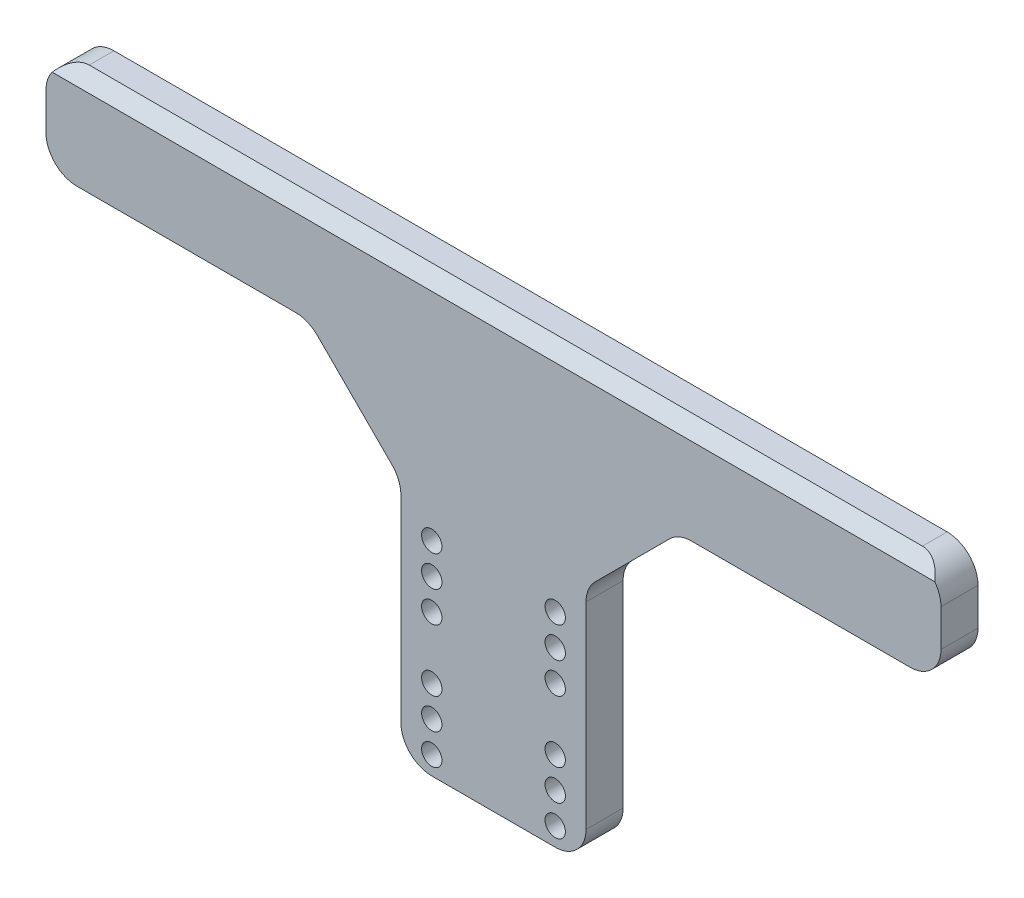
ISO-10303-21;
HEADER;
FILE_DESCRIPTION(('STEP AP214'),'2;1');
FILE_NAME('part.step','',(''),(''),'','','');
FILE_SCHEMA(('AUTOMOTIVE_DESIGN { 1 0 10303 214 1 1 1 1 }'));
ENDSEC;
DATA;
#1=APPLICATION_CONTEXT('core data for automotive mechanical design processes');
#2=APPLICATION_PROTOCOL_DEFINITION('international standard','automotive_design',2000,#1);
#3=PRODUCT_CONTEXT('',#1,'mechanical');
#4=PRODUCT('Part','Part','',(#3));
#5=PRODUCT_RELATED_PRODUCT_CATEGORY('part','',(#4));
#6=PRODUCT_DEFINITION_FORMATION('','',#4);
#7=PRODUCT_DEFINITION_CONTEXT('part definition',#1,'design');
#8=PRODUCT_DEFINITION('design','',#6,#7);
#9=PRODUCT_DEFINITION_SHAPE('','',#8);
#10=(LENGTH_UNIT() NAMED_UNIT(*) SI_UNIT(.MILLI.,.METRE.));
#11=(NAMED_UNIT(*) PLANE_ANGLE_UNIT() SI_UNIT($,.RADIAN.));
#12=(NAMED_UNIT(*) SI_UNIT($,.STERADIAN.) SOLID_ANGLE_UNIT());
#13=UNCERTAINTY_MEASURE_WITH_UNIT(LENGTH_MEASURE(1.E-05),#10,'distance_accuracy_value','');
#14=(GEOMETRIC_REPRESENTATION_CONTEXT(3) GLOBAL_UNCERTAINTY_ASSIGNED_CONTEXT((#13)) GLOBAL_UNIT_ASSIGNED_CONTEXT((#10,
#11,#12)) REPRESENTATION_CONTEXT('',''));
#15=CARTESIAN_POINT('',(0.,0.,0.));
#16=DIRECTION('',(0.,0.,1.));
#17=DIRECTION('',(1.,0.,0.));
#18=AXIS2_PLACEMENT_3D('',#15,#16,#17);
#19=CARTESIAN_POINT('',(0.,0.,6.));
#20=DIRECTION('',(1.,0.,0.));
#21=DIRECTION('',(0.,0.,-1.));
#22=AXIS2_PLACEMENT_3D('',#19,#20,#21);
#23=PLANE('',#22);
#24=DIRECTION('',(0.,-1.,0.));
#25=VECTOR('',#24,1.);
#26=CARTESIAN_POINT('',(0.,0.,6.));
#27=LINE('',#26,#25);
#28=CARTESIAN_POINT('',(0.,65.,6.));
#29=VERTEX_POINT('',#28);
#30=CARTESIAN_POINT('',(0.,59.,6.));
#31=VERTEX_POINT('',#30);
#32=EDGE_CURVE('E408',#29,#31,#27,.T.);
#33=ORIENTED_EDGE('',*,*,#32,.F.);
#34=DIRECTION('',(0.,0.,1.));
#35=VECTOR('',#34,1.);
#36=CARTESIAN_POINT('',(0.,65.,0.));
#37=LINE('',#36,#35);
#38=CARTESIAN_POINT('',(0.,65.,0.));
#39=VERTEX_POINT('',#38);
#40=EDGE_CURVE('E234',#29,#39,#37,.F.);
#41=ORIENTED_EDGE('',*,*,#40,.T.);
#42=DIRECTION('',(0.,-1.,0.));
#43=VECTOR('',#42,1.);
#44=CARTESIAN_POINT('',(0.,0.,0.));
#45=LINE('',#44,#43);
#46=CARTESIAN_POINT('',(0.,59.,0.));
#47=VERTEX_POINT('',#46);
#48=EDGE_CURVE('E407',#39,#47,#45,.T.);
#49=ORIENTED_EDGE('',*,*,#48,.T.);
#50=DIRECTION('',(0.,0.,1.));
#51=VECTOR('',#50,1.);
#52=CARTESIAN_POINT('',(0.,59.,6.));
#53=LINE('',#52,#51);
#54=EDGE_CURVE('E231',#47,#31,#53,.T.);
#55=ORIENTED_EDGE('',*,*,#54,.T.);
#56=EDGE_LOOP('',(#33,#41,#49,#55));
#57=FACE_BOUND('',#56,.T.);
#58=ADVANCED_FACE('F32',(#57),#23,.F.);
#59=CARTESIAN_POINT('',(0.,0.,6.));
#60=DIRECTION('',(0.,1.,0.));
#61=DIRECTION('',(0.,0.,1.));
#62=AXIS2_PLACEMENT_3D('',#59,#60,#61);
#63=PLANE('',#62);
#64=DIRECTION('',(1.,0.,0.));
#65=VECTOR('',#64,1.);
#66=CARTESIAN_POINT('',(0.,0.,0.));
#67=LINE('',#66,#65);
#68=CARTESIAN_POINT('',(62.5,0.,0.));
#69=VERTEX_POINT('',#68);
#70=CARTESIAN_POINT('',(82.5,0.,0.));
#71=VERTEX_POINT('',#70);
#72=EDGE_CURVE('E419',#69,#71,#67,.T.);
#73=ORIENTED_EDGE('',*,*,#72,.T.);
#74=DIRECTION('',(0.,0.,1.));
#75=VECTOR('',#74,1.);
#76=CARTESIAN_POINT('',(82.5,0.,6.));
#77=LINE('',#76,#75);
#78=CARTESIAN_POINT('',(82.5,0.,6.));
#79=VERTEX_POINT('',#78);
#80=EDGE_CURVE('E268',#71,#79,#77,.T.);
#81=ORIENTED_EDGE('',*,*,#80,.T.);
#82=DIRECTION('',(1.,0.,0.));
#83=VECTOR('',#82,1.);
#84=CARTESIAN_POINT('',(0.,0.,6.));
#85=LINE('',#84,#83);
#86=CARTESIAN_POINT('',(62.5,0.,6.));
#87=VERTEX_POINT('',#86);
#88=EDGE_CURVE('E411',#87,#79,#85,.T.);
#89=ORIENTED_EDGE('',*,*,#88,.F.);
#90=DIRECTION('',(0.,0.,1.));
#91=VECTOR('',#90,1.);
#92=CARTESIAN_POINT('',(62.5,0.,6.));
#93=LINE('',#92,#91);
#94=EDGE_CURVE('E266',#87,#69,#93,.F.);
#95=ORIENTED_EDGE('',*,*,#94,.T.);
#96=EDGE_LOOP('',(#73,#81,#89,#95));
#97=FACE_BOUND('',#96,.T.);
#98=ADVANCED_FACE('F458',(#97),#63,.F.);
#99=CARTESIAN_POINT('',(145.,0.,6.));
#100=DIRECTION('',(-1.,0.,0.));
#101=DIRECTION('',(0.,0.,1.));
#102=AXIS2_PLACEMENT_3D('',#99,#100,#101);
#103=PLANE('',#102);
#104=DIRECTION('',(0.,1.,0.));
#105=VECTOR('',#104,1.);
#106=CARTESIAN_POINT('',(145.,0.,0.));
#107=LINE('',#106,#105);
#108=CARTESIAN_POINT('',(145.,59.,0.));
#109=VERTEX_POINT('',#108);
#110=CARTESIAN_POINT('',(145.,65.,0.));
#111=VERTEX_POINT('',#110);
#112=EDGE_CURVE('E412',#109,#111,#107,.T.);
#113=ORIENTED_EDGE('',*,*,#112,.T.);
#114=DIRECTION('',(0.,0.,1.));
#115=VECTOR('',#114,1.);
#116=CARTESIAN_POINT('',(145.,65.,3.99999999999997));
#117=LINE('',#116,#115);
#118=CARTESIAN_POINT('',(145.,65.,6.));
#119=VERTEX_POINT('',#118);
#120=EDGE_CURVE('E248',#111,#119,#117,.T.);
#121=ORIENTED_EDGE('',*,*,#120,.T.);
#122=DIRECTION('',(0.,1.,0.));
#123=VECTOR('',#122,1.);
#124=CARTESIAN_POINT('',(145.,0.,6.));
#125=LINE('',#124,#123);
#126=CARTESIAN_POINT('',(145.,59.,6.));
#127=VERTEX_POINT('',#126);
#128=EDGE_CURVE('E207',#127,#119,#125,.T.);
#129=ORIENTED_EDGE('',*,*,#128,.F.);
#130=DIRECTION('',(0.,0.,1.));
#131=VECTOR('',#130,1.);
#132=CARTESIAN_POINT('',(145.,59.,6.));
#133=LINE('',#132,#131);
#134=EDGE_CURVE('E54',#127,#109,#133,.F.);
#135=ORIENTED_EDGE('',*,*,#134,.T.);
#136=EDGE_LOOP('',(#113,#121,#129,#135));
#137=FACE_BOUND('',#136,.T.);
#138=ADVANCED_FACE('F422',(#137),#103,.F.);
#139=CARTESIAN_POINT('',(0.,0.,6.));
#140=DIRECTION('',(0.,0.,-1.));
#141=DIRECTION('',(-1.,0.,0.));
#142=AXIS2_PLACEMENT_3D('',#139,#140,#141);
#143=PLANE('',#142);
#144=CARTESIAN_POINT('',(82.5,8.,6.));
#145=DIRECTION('',(0.,0.,-1.));
#146=DIRECTION('',(-1.,0.,0.));
#147=AXIS2_PLACEMENT_3D('',#144,#145,#146);
#148=CIRCLE('',#147,1.65);
#149=CARTESIAN_POINT('',(80.85,8.,6.));
#150=VERTEX_POINT('',#149);
#151=EDGE_CURVE('E398',#150,#150,#148,.T.);
#152=ORIENTED_EDGE('',*,*,#151,.T.);
#153=EDGE_LOOP('',(#152));
#154=FACE_BOUND('',#153,.T.);
#155=CARTESIAN_POINT('',(82.5,28.,6.));
#156=DIRECTION('',(0.,0.,-1.));
#157=DIRECTION('',(-1.,0.,0.));
#158=AXIS2_PLACEMENT_3D('',#155,#156,#157);
#159=CIRCLE('',#158,1.65);
#160=CARTESIAN_POINT('',(80.85,28.,6.));
#161=VERTEX_POINT('',#160);
#162=EDGE_CURVE('E395',#161,#161,#159,.T.);
#163=ORIENTED_EDGE('',*,*,#162,.T.);
#164=EDGE_LOOP('',(#163));
#165=FACE_BOUND('',#164,.T.);
#166=CARTESIAN_POINT('',(62.5,33.,6.));
#167=DIRECTION('',(0.,0.,-1.));
#168=DIRECTION('',(-1.,0.,0.));
#169=AXIS2_PLACEMENT_3D('',#166,#167,#168);
#170=CIRCLE('',#169,1.65);
#171=CARTESIAN_POINT('',(60.85,33.,6.));
#172=VERTEX_POINT('',#171);
#173=EDGE_CURVE('E392',#172,#172,#170,.T.);
#174=ORIENTED_EDGE('',*,*,#173,.T.);
#175=EDGE_LOOP('',(#174));
#176=FACE_BOUND('',#175,.T.);
#177=CARTESIAN_POINT('',(62.5,13.,6.));
#178=DIRECTION('',(0.,0.,-1.));
#179=DIRECTION('',(-1.,0.,0.));
#180=AXIS2_PLACEMENT_3D('',#177,#178,#179);
#181=CIRCLE('',#180,1.65);
#182=CARTESIAN_POINT('',(60.85,13.,6.));
#183=VERTEX_POINT('',#182);
#184=EDGE_CURVE('E389',#183,#183,#181,.T.);
#185=ORIENTED_EDGE('',*,*,#184,.T.);
#186=EDGE_LOOP('',(#185));
#187=FACE_BOUND('',#186,.T.);
#188=CARTESIAN_POINT('',(82.4999999999999,13.,6.));
#189=DIRECTION('',(0.,0.,-1.));
#190=DIRECTION('',(-1.,0.,0.));
#191=AXIS2_PLACEMENT_3D('',#188,#189,#190);
#192=CIRCLE('',#191,1.65);
#193=CARTESIAN_POINT('',(80.85,13.,6.));
#194=VERTEX_POINT('',#193);
#195=EDGE_CURVE('E386',#194,#194,#192,.T.);
#196=ORIENTED_EDGE('',*,*,#195,.T.);
#197=EDGE_LOOP('',(#196));
#198=FACE_BOUND('',#197,.T.);
#199=CARTESIAN_POINT('',(82.4999999999999,33.,6.));
#200=DIRECTION('',(0.,0.,-1.));
#201=DIRECTION('',(-1.,0.,0.));
#202=AXIS2_PLACEMENT_3D('',#199,#200,#201);
#203=CIRCLE('',#202,1.65);
#204=CARTESIAN_POINT('',(80.85,33.,6.));
#205=VERTEX_POINT('',#204);
#206=EDGE_CURVE('E383',#205,#205,#203,.T.);
#207=ORIENTED_EDGE('',*,*,#206,.T.);
#208=EDGE_LOOP('',(#207));
#209=FACE_BOUND('',#208,.T.);
#210=CARTESIAN_POINT('',(62.5,8.,6.));
#211=DIRECTION('',(0.,0.,-1.));
#212=DIRECTION('',(-1.,0.,0.));
#213=AXIS2_PLACEMENT_3D('',#210,#211,#212);
#214=CIRCLE('',#213,1.65000000000002);
#215=CARTESIAN_POINT('',(60.85,8.,6.));
#216=VERTEX_POINT('',#215);
#217=EDGE_CURVE('E380',#216,#216,#214,.T.);
#218=ORIENTED_EDGE('',*,*,#217,.T.);
#219=EDGE_LOOP('',(#218));
#220=FACE_BOUND('',#219,.T.);
#221=CARTESIAN_POINT('',(62.5,28.,6.));
#222=DIRECTION('',(0.,0.,-1.));
#223=DIRECTION('',(-1.,0.,0.));
#224=AXIS2_PLACEMENT_3D('',#221,#222,#223);
#225=CIRCLE('',#224,1.65000000000002);
#226=CARTESIAN_POINT('',(60.85,28.,6.));
#227=VERTEX_POINT('',#226);
#228=EDGE_CURVE('E377',#227,#227,#225,.T.);
#229=ORIENTED_EDGE('',*,*,#228,.T.);
#230=EDGE_LOOP('',(#229));
#231=FACE_BOUND('',#230,.T.);
#232=CARTESIAN_POINT('',(82.5,23.,6.));
#233=DIRECTION('',(0.,0.,-1.));
#234=DIRECTION('',(-1.,0.,0.));
#235=AXIS2_PLACEMENT_3D('',#232,#233,#234);
#236=CIRCLE('',#235,1.65);
#237=CARTESIAN_POINT('',(80.85,23.,6.));
#238=VERTEX_POINT('',#237);
#239=EDGE_CURVE('E374',#238,#238,#236,.T.);
#240=ORIENTED_EDGE('',*,*,#239,.T.);
#241=EDGE_LOOP('',(#240));
#242=FACE_BOUND('',#241,.T.);
#243=CARTESIAN_POINT('',(82.5,3.,6.));
#244=DIRECTION('',(0.,0.,-1.));
#245=DIRECTION('',(-1.,0.,0.));
#246=AXIS2_PLACEMENT_3D('',#243,#244,#245);
#247=CIRCLE('',#246,1.65);
#248=CARTESIAN_POINT('',(80.85,3.,6.));
#249=VERTEX_POINT('',#248);
#250=EDGE_CURVE('E371',#249,#249,#247,.T.);
#251=ORIENTED_EDGE('',*,*,#250,.T.);
#252=EDGE_LOOP('',(#251));
#253=FACE_BOUND('',#252,.T.);
#254=CARTESIAN_POINT('',(62.5,3.,6.));
#255=DIRECTION('',(0.,0.,-1.));
#256=DIRECTION('',(-1.,0.,0.));
#257=AXIS2_PLACEMENT_3D('',#254,#255,#256);
#258=CIRCLE('',#257,1.65000000000001);
#259=CARTESIAN_POINT('',(60.85,3.,6.));
#260=VERTEX_POINT('',#259);
#261=EDGE_CURVE('E357',#260,#260,#258,.T.);
#262=ORIENTED_EDGE('',*,*,#261,.T.);
#263=EDGE_LOOP('',(#262));
#264=FACE_BOUND('',#263,.T.);
#265=CARTESIAN_POINT('',(62.5,23.,6.));
#266=DIRECTION('',(0.,0.,-1.));
#267=DIRECTION('',(-1.,0.,0.));
#268=AXIS2_PLACEMENT_3D('',#265,#266,#267);
#269=CIRCLE('',#268,1.65000000000001);
#270=CARTESIAN_POINT('',(60.85,23.,6.));
#271=VERTEX_POINT('',#270);
#272=EDGE_CURVE('E404',#271,#271,#269,.T.);
#273=ORIENTED_EDGE('',*,*,#272,.T.);
#274=EDGE_LOOP('',(#273));
#275=FACE_BOUND('',#274,.T.);
#276=DIRECTION('',(-1.,0.,0.));
#277=VECTOR('',#276,1.);
#278=CARTESIAN_POINT('',(0.,68.,6.));
#279=LINE('',#278,#277);
#280=CARTESIAN_POINT('',(144.,68.,6.));
#281=VERTEX_POINT('',#280);
#282=CARTESIAN_POINT('',(1.,68.,6.));
#283=VERTEX_POINT('',#282);
#284=EDGE_CURVE('E202',#281,#283,#279,.T.);
#285=ORIENTED_EDGE('',*,*,#284,.T.);
#286=CARTESIAN_POINT('',(5.,65.,6.));
#287=DIRECTION('',(0.,0.,-1.));
#288=DIRECTION('',(-1.,0.,0.));
#289=AXIS2_PLACEMENT_3D('',#286,#287,#288);
#290=CIRCLE('',#289,5.);
#291=EDGE_CURVE('E182',#283,#29,#290,.F.);
#292=ORIENTED_EDGE('',*,*,#291,.T.);
#293=ORIENTED_EDGE('',*,*,#32,.T.);
#294=CARTESIAN_POINT('',(5.,59.,6.));
#295=DIRECTION('',(0.,0.,-1.));
#296=DIRECTION('',(-1.,0.,0.));
#297=AXIS2_PLACEMENT_3D('',#294,#295,#296);
#298=CIRCLE('',#297,5.);
#299=CARTESIAN_POINT('',(5.,54.,6.));
#300=VERTEX_POINT('',#299);
#301=EDGE_CURVE('E187',#31,#300,#298,.F.);
#302=ORIENTED_EDGE('',*,*,#301,.T.);
#303=DIRECTION('',(1.,0.,0.));
#304=VECTOR('',#303,1.);
#305=CARTESIAN_POINT('',(0.,54.,6.));
#306=LINE('',#305,#304);
#307=CARTESIAN_POINT('',(40.4289321881344,54.,6.));
#308=VERTEX_POINT('',#307);
#309=EDGE_CURVE('E303',#300,#308,#306,.T.);
#310=ORIENTED_EDGE('',*,*,#309,.T.);
#311=CARTESIAN_POINT('',(40.4289321881344,49.,6.));
#312=DIRECTION('',(0.,0.,-1.));
#313=DIRECTION('',(-1.,0.,0.));
#314=AXIS2_PLACEMENT_3D('',#311,#312,#313);
#315=CIRCLE('',#314,5.);
#316=CARTESIAN_POINT('',(43.9644660940671,52.5355339059328,6.));
#317=VERTEX_POINT('',#316);
#318=EDGE_CURVE('E40',#308,#317,#315,.T.);
#319=ORIENTED_EDGE('',*,*,#318,.T.);
#320=DIRECTION('',(-0.707106781186551,0.707106781186544,0.));
#321=VECTOR('',#320,1.);
#322=CARTESIAN_POINT('',(48.2499999999997,48.2500000000002,6.));
#323=LINE('',#322,#321);
#324=CARTESIAN_POINT('',(56.0355339059327,40.4644660940673,6.));
#325=VERTEX_POINT('',#324);
#326=EDGE_CURVE('E213',#317,#325,#323,.F.);
#327=ORIENTED_EDGE('',*,*,#326,.T.);
#328=CARTESIAN_POINT('',(52.5,36.9289321881346,6.));
#329=DIRECTION('',(0.,0.,-1.));
#330=DIRECTION('',(-1.,0.,0.));
#331=AXIS2_PLACEMENT_3D('',#328,#329,#330);
#332=CIRCLE('',#331,5.);
#333=CARTESIAN_POINT('',(57.5,36.9289321881346,6.));
#334=VERTEX_POINT('',#333);
#335=EDGE_CURVE('E296',#325,#334,#332,.T.);
#336=ORIENTED_EDGE('',*,*,#335,.T.);
#337=DIRECTION('',(0.,-1.,0.));
#338=VECTOR('',#337,1.);
#339=CARTESIAN_POINT('',(57.5,0.,6.));
#340=LINE('',#339,#338);
#341=CARTESIAN_POINT('',(57.5,5.,6.));
#342=VERTEX_POINT('',#341);
#343=EDGE_CURVE('E323',#334,#342,#340,.T.);
#344=ORIENTED_EDGE('',*,*,#343,.T.);
#345=CARTESIAN_POINT('',(62.5,5.,6.));
#346=DIRECTION('',(0.,0.,-1.));
#347=DIRECTION('',(-1.,0.,0.));
#348=AXIS2_PLACEMENT_3D('',#345,#346,#347);
#349=CIRCLE('',#348,5.);
#350=EDGE_CURVE('E222',#342,#87,#349,.F.);
#351=ORIENTED_EDGE('',*,*,#350,.T.);
#352=ORIENTED_EDGE('',*,*,#88,.T.);
#353=CARTESIAN_POINT('',(82.5,5.,6.));
#354=DIRECTION('',(0.,0.,-1.));
#355=DIRECTION('',(-1.,0.,0.));
#356=AXIS2_PLACEMENT_3D('',#353,#354,#355);
#357=CIRCLE('',#356,5.);
#358=CARTESIAN_POINT('',(87.5,5.,6.));
#359=VERTEX_POINT('',#358);
#360=EDGE_CURVE('E224',#79,#359,#357,.F.);
#361=ORIENTED_EDGE('',*,*,#360,.T.);
#362=DIRECTION('',(0.,1.,0.));
#363=VECTOR('',#362,1.);
#364=CARTESIAN_POINT('',(87.5,0.,6.));
#365=LINE('',#364,#363);
#366=CARTESIAN_POINT('',(87.5,36.9289321881344,6.));
#367=VERTEX_POINT('',#366);
#368=EDGE_CURVE('E329',#359,#367,#365,.T.);
#369=ORIENTED_EDGE('',*,*,#368,.T.);
#370=CARTESIAN_POINT('',(92.5,36.9289321881344,6.));
#371=DIRECTION('',(0.,0.,-1.));
#372=DIRECTION('',(-1.,0.,0.));
#373=AXIS2_PLACEMENT_3D('',#370,#371,#372);
#374=CIRCLE('',#373,5.);
#375=CARTESIAN_POINT('',(88.9644660940672,40.4644660940672,6.));
#376=VERTEX_POINT('',#375);
#377=EDGE_CURVE('E290',#367,#376,#374,.T.);
#378=ORIENTED_EDGE('',*,*,#377,.T.);
#379=DIRECTION('',(-0.707106781186544,-0.707106781186551,0.));
#380=VECTOR('',#379,1.);
#381=CARTESIAN_POINT('',(24.2500000000005,-24.2500000000003,6.));
#382=LINE('',#381,#380);
#383=CARTESIAN_POINT('',(101.035533905933,52.5355339059327,6.));
#384=VERTEX_POINT('',#383);
#385=EDGE_CURVE('E201',#376,#384,#382,.F.);
#386=ORIENTED_EDGE('',*,*,#385,.T.);
#387=CARTESIAN_POINT('',(104.571067811865,49.,6.));
#388=DIRECTION('',(0.,0.,-1.));
#389=DIRECTION('',(-1.,0.,0.));
#390=AXIS2_PLACEMENT_3D('',#387,#388,#389);
#391=CIRCLE('',#390,5.);
#392=CARTESIAN_POINT('',(104.571067811865,54.,6.));
#393=VERTEX_POINT('',#392);
#394=EDGE_CURVE('E288',#384,#393,#391,.T.);
#395=ORIENTED_EDGE('',*,*,#394,.T.);
#396=DIRECTION('',(1.,0.,0.));
#397=VECTOR('',#396,1.);
#398=CARTESIAN_POINT('',(0.,54.,6.));
#399=LINE('',#398,#397);
#400=CARTESIAN_POINT('',(140.,54.,6.));
#401=VERTEX_POINT('',#400);
#402=EDGE_CURVE('E440',#393,#401,#399,.T.);
#403=ORIENTED_EDGE('',*,*,#402,.T.);
#404=CARTESIAN_POINT('',(140.,59.,6.));
#405=DIRECTION('',(0.,0.,-1.));
#406=DIRECTION('',(-1.,0.,0.));
#407=AXIS2_PLACEMENT_3D('',#404,#405,#406);
#408=CIRCLE('',#407,5.);
#409=EDGE_CURVE('E226',#401,#127,#408,.F.);
#410=ORIENTED_EDGE('',*,*,#409,.T.);
#411=ORIENTED_EDGE('',*,*,#128,.T.);
#412=CARTESIAN_POINT('',(140.,65.,6.));
#413=DIRECTION('',(0.,0.,-1.));
#414=DIRECTION('',(-1.,0.,0.));
#415=AXIS2_PLACEMENT_3D('',#412,#413,#414);
#416=CIRCLE('',#415,5.);
#417=EDGE_CURVE('E228',#119,#281,#416,.F.);
#418=ORIENTED_EDGE('',*,*,#417,.T.);
#419=EDGE_LOOP('',(#285,#292,#293,#302,#310,#319,#327,#336,#344,#351,#352,#361,#369,#378,#386,
#395,#403,#410,#411,#418));
#420=FACE_BOUND('',#419,.T.);
#421=ADVANCED_FACE('F300',(#154,#165,#176,#187,#198,#209,#220,#231,#242,#253,#264,#275,#420),
#143,.F.);
#422=CARTESIAN_POINT('',(0.,0.,0.));
#423=DIRECTION('',(0.,0.,-1.));
#424=DIRECTION('',(-1.,0.,0.));
#425=AXIS2_PLACEMENT_3D('',#422,#423,#424);
#426=PLANE('',#425);
#427=ORIENTED_EDGE('',*,*,#48,.F.);
#428=CARTESIAN_POINT('',(5.,65.,0.));
#429=DIRECTION('',(0.,0.,-1.));
#430=DIRECTION('',(-1.,0.,0.));
#431=AXIS2_PLACEMENT_3D('',#428,#429,#430);
#432=CIRCLE('',#431,5.);
#433=CARTESIAN_POINT('',(5.,70.,0.));
#434=VERTEX_POINT('',#433);
#435=EDGE_CURVE('E245',#39,#434,#432,.T.);
#436=ORIENTED_EDGE('',*,*,#435,.T.);
#437=DIRECTION('',(-1.,0.,0.));
#438=VECTOR('',#437,1.);
#439=CARTESIAN_POINT('',(0.,70.,0.));
#440=LINE('',#439,#438);
#441=CARTESIAN_POINT('',(140.,70.,0.));
#442=VERTEX_POINT('',#441);
#443=EDGE_CURVE('E196',#442,#434,#440,.T.);
#444=ORIENTED_EDGE('',*,*,#443,.F.);
#445=CARTESIAN_POINT('',(140.,65.,0.));
#446=DIRECTION('',(0.,0.,-1.));
#447=DIRECTION('',(-1.,0.,0.));
#448=AXIS2_PLACEMENT_3D('',#445,#446,#447);
#449=CIRCLE('',#448,5.);
#450=EDGE_CURVE('E47',#442,#111,#449,.T.);
#451=ORIENTED_EDGE('',*,*,#450,.T.);
#452=ORIENTED_EDGE('',*,*,#112,.F.);
#453=CARTESIAN_POINT('',(140.,59.,0.));
#454=DIRECTION('',(0.,0.,-1.));
#455=DIRECTION('',(-1.,0.,0.));
#456=AXIS2_PLACEMENT_3D('',#453,#454,#455);
#457=CIRCLE('',#456,5.);
#458=CARTESIAN_POINT('',(140.,54.,0.));
#459=VERTEX_POINT('',#458);
#460=EDGE_CURVE('E242',#109,#459,#457,.T.);
#461=ORIENTED_EDGE('',*,*,#460,.T.);
#462=DIRECTION('',(-1.,0.,0.));
#463=VECTOR('',#462,1.);
#464=CARTESIAN_POINT('',(145.,54.,0.));
#465=LINE('',#464,#463);
#466=CARTESIAN_POINT('',(104.571067811865,54.,0.));
#467=VERTEX_POINT('',#466);
#468=EDGE_CURVE('E432',#459,#467,#465,.T.);
#469=ORIENTED_EDGE('',*,*,#468,.T.);
#470=CARTESIAN_POINT('',(104.571067811865,49.,0.));
#471=DIRECTION('',(0.,0.,-1.));
#472=DIRECTION('',(-1.,0.,0.));
#473=AXIS2_PLACEMENT_3D('',#470,#471,#472);
#474=CIRCLE('',#473,5.);
#475=CARTESIAN_POINT('',(101.035533905933,52.5355339059327,0.));
#476=VERTEX_POINT('',#475);
#477=EDGE_CURVE('E286',#467,#476,#474,.F.);
#478=ORIENTED_EDGE('',*,*,#477,.T.);
#479=DIRECTION('',(0.707106781186544,0.707106781186551,0.));
#480=VECTOR('',#479,1.);
#481=CARTESIAN_POINT('',(87.5,38.9999999999999,0.));
#482=LINE('',#481,#480);
#483=CARTESIAN_POINT('',(88.9644660940672,40.4644660940672,0.));
#484=VERTEX_POINT('',#483);
#485=EDGE_CURVE('E205',#476,#484,#482,.F.);
#486=ORIENTED_EDGE('',*,*,#485,.T.);
#487=CARTESIAN_POINT('',(92.5,36.9289321881344,0.));
#488=DIRECTION('',(0.,0.,-1.));
#489=DIRECTION('',(-1.,0.,0.));
#490=AXIS2_PLACEMENT_3D('',#487,#488,#489);
#491=CIRCLE('',#490,5.);
#492=CARTESIAN_POINT('',(87.5,36.9289321881344,0.));
#493=VERTEX_POINT('',#492);
#494=EDGE_CURVE('E292',#484,#493,#491,.F.);
#495=ORIENTED_EDGE('',*,*,#494,.T.);
#496=DIRECTION('',(0.,-1.,0.));
#497=VECTOR('',#496,1.);
#498=CARTESIAN_POINT('',(87.5,0.,0.));
#499=LINE('',#498,#497);
#500=CARTESIAN_POINT('',(87.5,5.,0.));
#501=VERTEX_POINT('',#500);
#502=EDGE_CURVE('E437',#493,#501,#499,.T.);
#503=ORIENTED_EDGE('',*,*,#502,.T.);
#504=CARTESIAN_POINT('',(82.5,5.,0.));
#505=DIRECTION('',(0.,0.,-1.));
#506=DIRECTION('',(-1.,0.,0.));
#507=AXIS2_PLACEMENT_3D('',#504,#505,#506);
#508=CIRCLE('',#507,5.);
#509=EDGE_CURVE('E240',#501,#71,#508,.T.);
#510=ORIENTED_EDGE('',*,*,#509,.T.);
#511=ORIENTED_EDGE('',*,*,#72,.F.);
#512=CARTESIAN_POINT('',(62.5,5.,0.));
#513=DIRECTION('',(0.,0.,-1.));
#514=DIRECTION('',(-1.,0.,0.));
#515=AXIS2_PLACEMENT_3D('',#512,#513,#514);
#516=CIRCLE('',#515,5.);
#517=CARTESIAN_POINT('',(57.5,5.,0.));
#518=VERTEX_POINT('',#517);
#519=EDGE_CURVE('E238',#69,#518,#516,.T.);
#520=ORIENTED_EDGE('',*,*,#519,.T.);
#521=DIRECTION('',(0.,1.,0.));
#522=VECTOR('',#521,1.);
#523=CARTESIAN_POINT('',(57.5,0.,0.));
#524=LINE('',#523,#522);
#525=CARTESIAN_POINT('',(57.5,36.9289321881346,0.));
#526=VERTEX_POINT('',#525);
#527=EDGE_CURVE('E324',#518,#526,#524,.T.);
#528=ORIENTED_EDGE('',*,*,#527,.T.);
#529=CARTESIAN_POINT('',(52.5,36.9289321881346,0.));
#530=DIRECTION('',(0.,0.,-1.));
#531=DIRECTION('',(-1.,0.,0.));
#532=AXIS2_PLACEMENT_3D('',#529,#530,#531);
#533=CIRCLE('',#532,5.);
#534=CARTESIAN_POINT('',(56.0355339059327,40.4644660940673,0.));
#535=VERTEX_POINT('',#534);
#536=EDGE_CURVE('E294',#526,#535,#533,.F.);
#537=ORIENTED_EDGE('',*,*,#536,.T.);
#538=DIRECTION('',(0.707106781186551,-0.707106781186544,0.));
#539=VECTOR('',#538,1.);
#540=CARTESIAN_POINT('',(42.4999999999999,54.,0.));
#541=LINE('',#540,#539);
#542=CARTESIAN_POINT('',(43.9644660940671,52.5355339059328,0.));
#543=VERTEX_POINT('',#542);
#544=EDGE_CURVE('E216',#535,#543,#541,.F.);
#545=ORIENTED_EDGE('',*,*,#544,.T.);
#546=CARTESIAN_POINT('',(40.4289321881344,49.,0.));
#547=DIRECTION('',(0.,0.,-1.));
#548=DIRECTION('',(-1.,0.,0.));
#549=AXIS2_PLACEMENT_3D('',#546,#547,#548);
#550=CIRCLE('',#549,5.);
#551=CARTESIAN_POINT('',(40.4289321881344,54.,0.));
#552=VERTEX_POINT('',#551);
#553=EDGE_CURVE('E11',#543,#552,#550,.F.);
#554=ORIENTED_EDGE('',*,*,#553,.T.);
#555=DIRECTION('',(-1.,0.,0.));
#556=VECTOR('',#555,1.);
#557=CARTESIAN_POINT('',(0.,54.,0.));
#558=LINE('',#557,#556);
#559=CARTESIAN_POINT('',(5.,54.,0.));
#560=VERTEX_POINT('',#559);
#561=EDGE_CURVE('E318',#552,#560,#558,.T.);
#562=ORIENTED_EDGE('',*,*,#561,.T.);
#563=CARTESIAN_POINT('',(5.,59.,0.));
#564=DIRECTION('',(0.,0.,-1.));
#565=DIRECTION('',(-1.,0.,0.));
#566=AXIS2_PLACEMENT_3D('',#563,#564,#565);
#567=CIRCLE('',#566,5.);
#568=EDGE_CURVE('E236',#560,#47,#567,.T.);
#569=ORIENTED_EDGE('',*,*,#568,.T.);
#570=EDGE_LOOP('',(#427,#436,#444,#451,#452,#461,#469,#478,#486,#495,#503,#510,#511,#520,#528,
#537,#545,#554,#562,#569));
#571=FACE_BOUND('',#570,.T.);
#572=CARTESIAN_POINT('',(82.5,8.,0.));
#573=DIRECTION('',(0.,0.,1.));
#574=DIRECTION('',(1.,0.,0.));
#575=AXIS2_PLACEMENT_3D('',#572,#573,#574);
#576=CIRCLE('',#575,1.65);
#577=CARTESIAN_POINT('',(84.15,8.,0.));
#578=VERTEX_POINT('',#577);
#579=EDGE_CURVE('E345',#578,#578,#576,.T.);
#580=ORIENTED_EDGE('',*,*,#579,.T.);
#581=EDGE_LOOP('',(#580));
#582=FACE_BOUND('',#581,.T.);
#583=CARTESIAN_POINT('',(82.5,28.,0.));
#584=DIRECTION('',(0.,0.,1.));
#585=DIRECTION('',(-1.,0.,0.));
#586=AXIS2_PLACEMENT_3D('',#583,#584,#585);
#587=CIRCLE('',#586,1.65);
#588=CARTESIAN_POINT('',(80.85,28.,0.));
#589=VERTEX_POINT('',#588);
#590=EDGE_CURVE('E349',#589,#589,#587,.T.);
#591=ORIENTED_EDGE('',*,*,#590,.T.);
#592=EDGE_LOOP('',(#591));
#593=FACE_BOUND('',#592,.T.);
#594=CARTESIAN_POINT('',(62.5,33.,0.));
#595=DIRECTION('',(0.,0.,1.));
#596=DIRECTION('',(1.,0.,0.));
#597=AXIS2_PLACEMENT_3D('',#594,#595,#596);
#598=CIRCLE('',#597,1.65);
#599=CARTESIAN_POINT('',(64.15,33.,0.));
#600=VERTEX_POINT('',#599);
#601=EDGE_CURVE('E339',#600,#600,#598,.T.);
#602=ORIENTED_EDGE('',*,*,#601,.T.);
#603=EDGE_LOOP('',(#602));
#604=FACE_BOUND('',#603,.T.);
#605=CARTESIAN_POINT('',(62.5,13.,0.));
#606=DIRECTION('',(0.,0.,1.));
#607=DIRECTION('',(-1.,0.,0.));
#608=AXIS2_PLACEMENT_3D('',#605,#606,#607);
#609=CIRCLE('',#608,1.65);
#610=CARTESIAN_POINT('',(60.85,13.,0.));
#611=VERTEX_POINT('',#610);
#612=EDGE_CURVE('E336',#611,#611,#609,.T.);
#613=ORIENTED_EDGE('',*,*,#612,.T.);
#614=EDGE_LOOP('',(#613));
#615=FACE_BOUND('',#614,.T.);
#616=CARTESIAN_POINT('',(82.4999999999999,13.,0.));
#617=DIRECTION('',(0.,0.,1.));
#618=DIRECTION('',(1.,0.,0.));
#619=AXIS2_PLACEMENT_3D('',#616,#617,#618);
#620=CIRCLE('',#619,1.65);
#621=CARTESIAN_POINT('',(84.1499999999999,13.,0.));
#622=VERTEX_POINT('',#621);
#623=EDGE_CURVE('E340',#622,#622,#620,.T.);
#624=ORIENTED_EDGE('',*,*,#623,.T.);
#625=EDGE_LOOP('',(#624));
#626=FACE_BOUND('',#625,.T.);
#627=CARTESIAN_POINT('',(82.4999999999999,33.,0.));
#628=DIRECTION('',(0.,0.,1.));
#629=DIRECTION('',(-1.,0.,0.));
#630=AXIS2_PLACEMENT_3D('',#627,#628,#629);
#631=CIRCLE('',#630,1.65);
#632=CARTESIAN_POINT('',(80.85,33.,0.));
#633=VERTEX_POINT('',#632);
#634=EDGE_CURVE('E335',#633,#633,#631,.T.);
#635=ORIENTED_EDGE('',*,*,#634,.T.);
#636=EDGE_LOOP('',(#635));
#637=FACE_BOUND('',#636,.T.);
#638=CARTESIAN_POINT('',(62.5,8.,0.));
#639=DIRECTION('',(0.,0.,1.));
#640=DIRECTION('',(-1.,0.,0.));
#641=AXIS2_PLACEMENT_3D('',#638,#639,#640);
#642=CIRCLE('',#641,1.65000000000002);
#643=CARTESIAN_POINT('',(60.85,8.,0.));
#644=VERTEX_POINT('',#643);
#645=EDGE_CURVE('E348',#644,#644,#642,.T.);
#646=ORIENTED_EDGE('',*,*,#645,.T.);
#647=EDGE_LOOP('',(#646));
#648=FACE_BOUND('',#647,.T.);
#649=CARTESIAN_POINT('',(62.5,28.,0.));
#650=DIRECTION('',(0.,0.,1.));
#651=DIRECTION('',(1.,0.,0.));
#652=AXIS2_PLACEMENT_3D('',#649,#650,#651);
#653=CIRCLE('',#652,1.65000000000002);
#654=CARTESIAN_POINT('',(64.15,28.,0.));
#655=VERTEX_POINT('',#654);
#656=EDGE_CURVE('E364',#655,#655,#653,.T.);
#657=ORIENTED_EDGE('',*,*,#656,.T.);
#658=EDGE_LOOP('',(#657));
#659=FACE_BOUND('',#658,.T.);
#660=CARTESIAN_POINT('',(82.5,23.,0.));
#661=DIRECTION('',(0.,0.,1.));
#662=DIRECTION('',(-1.,0.,0.));
#663=AXIS2_PLACEMENT_3D('',#660,#661,#662);
#664=CIRCLE('',#663,1.65);
#665=CARTESIAN_POINT('',(80.85,23.,0.));
#666=VERTEX_POINT('',#665);
#667=EDGE_CURVE('E361',#666,#666,#664,.T.);
#668=ORIENTED_EDGE('',*,*,#667,.T.);
#669=EDGE_LOOP('',(#668));
#670=FACE_BOUND('',#669,.T.);
#671=CARTESIAN_POINT('',(82.5,3.,0.));
#672=DIRECTION('',(0.,0.,1.));
#673=DIRECTION('',(1.,0.,0.));
#674=AXIS2_PLACEMENT_3D('',#671,#672,#673);
#675=CIRCLE('',#674,1.65);
#676=CARTESIAN_POINT('',(84.15,3.,0.));
#677=VERTEX_POINT('',#676);
#678=EDGE_CURVE('E358',#677,#677,#675,.T.);
#679=ORIENTED_EDGE('',*,*,#678,.T.);
#680=EDGE_LOOP('',(#679));
#681=FACE_BOUND('',#680,.T.);
#682=CARTESIAN_POINT('',(62.5,3.,0.));
#683=DIRECTION('',(0.,0.,1.));
#684=DIRECTION('',(-1.,0.,0.));
#685=AXIS2_PLACEMENT_3D('',#682,#683,#684);
#686=CIRCLE('',#685,1.65000000000001);
#687=CARTESIAN_POINT('',(60.85,3.,0.));
#688=VERTEX_POINT('',#687);
#689=EDGE_CURVE('E354',#688,#688,#686,.T.);
#690=ORIENTED_EDGE('',*,*,#689,.T.);
#691=EDGE_LOOP('',(#690));
#692=FACE_BOUND('',#691,.T.);
#693=CARTESIAN_POINT('',(62.5,23.,0.));
#694=DIRECTION('',(0.,0.,1.));
#695=DIRECTION('',(1.,0.,0.));
#696=AXIS2_PLACEMENT_3D('',#693,#694,#695);
#697=CIRCLE('',#696,1.65000000000001);
#698=CARTESIAN_POINT('',(64.15,23.,0.));
#699=VERTEX_POINT('',#698);
#700=EDGE_CURVE('E401',#699,#699,#697,.T.);
#701=ORIENTED_EDGE('',*,*,#700,.T.);
#702=EDGE_LOOP('',(#701));
#703=FACE_BOUND('',#702,.T.);
#704=ADVANCED_FACE('F316',(#571,#582,#593,#604,#615,#626,#637,#648,#659,#670,#681,#692,#703),
#426,.T.);
#705=CARTESIAN_POINT('',(62.5,23.,0.));
#706=DIRECTION('',(0.,0.,1.));
#707=DIRECTION('',(1.,0.,0.));
#708=AXIS2_PLACEMENT_3D('',#705,#706,#707);
#709=CYLINDRICAL_SURFACE('',#708,1.65000000000001);
#710=ORIENTED_EDGE('',*,*,#700,.F.);
#711=EDGE_LOOP('',(#710));
#712=FACE_BOUND('',#711,.T.);
#713=ORIENTED_EDGE('',*,*,#272,.F.);
#714=EDGE_LOOP('',(#713));
#715=FACE_BOUND('',#714,.T.);
#716=ADVANCED_FACE('F626',(#712,#715),#709,.F.);
#717=CARTESIAN_POINT('',(62.5,3.,0.));
#718=DIRECTION('',(0.,0.,1.));
#719=DIRECTION('',(1.,0.,0.));
#720=AXIS2_PLACEMENT_3D('',#717,#718,#719);
#721=CYLINDRICAL_SURFACE('',#720,1.65000000000001);
#722=ORIENTED_EDGE('',*,*,#689,.F.);
#723=EDGE_LOOP('',(#722));
#724=FACE_BOUND('',#723,.T.);
#725=ORIENTED_EDGE('',*,*,#261,.F.);
#726=EDGE_LOOP('',(#725));
#727=FACE_BOUND('',#726,.T.);
#728=ADVANCED_FACE('F747',(#724,#727),#721,.F.);
#729=CARTESIAN_POINT('',(82.5,3.,0.));
#730=DIRECTION('',(0.,0.,1.));
#731=DIRECTION('',(1.,0.,0.));
#732=AXIS2_PLACEMENT_3D('',#729,#730,#731);
#733=CYLINDRICAL_SURFACE('',#732,1.65);
#734=ORIENTED_EDGE('',*,*,#678,.F.);
#735=EDGE_LOOP('',(#734));
#736=FACE_BOUND('',#735,.T.);
#737=ORIENTED_EDGE('',*,*,#250,.F.);
#738=EDGE_LOOP('',(#737));
#739=FACE_BOUND('',#738,.T.);
#740=ADVANCED_FACE('F738',(#736,#739),#733,.F.);
#741=CARTESIAN_POINT('',(82.5,23.,0.));
#742=DIRECTION('',(0.,0.,1.));
#743=DIRECTION('',(1.,0.,0.));
#744=AXIS2_PLACEMENT_3D('',#741,#742,#743);
#745=CYLINDRICAL_SURFACE('',#744,1.65);
#746=ORIENTED_EDGE('',*,*,#667,.F.);
#747=EDGE_LOOP('',(#746));
#748=FACE_BOUND('',#747,.T.);
#749=ORIENTED_EDGE('',*,*,#239,.F.);
#750=EDGE_LOOP('',(#749));
#751=FACE_BOUND('',#750,.T.);
#752=ADVANCED_FACE('F729',(#748,#751),#745,.F.);
#753=CARTESIAN_POINT('',(62.5,28.,0.));
#754=DIRECTION('',(0.,0.,1.));
#755=DIRECTION('',(1.,0.,0.));
#756=AXIS2_PLACEMENT_3D('',#753,#754,#755);
#757=CYLINDRICAL_SURFACE('',#756,1.65000000000002);
#758=ORIENTED_EDGE('',*,*,#656,.F.);
#759=EDGE_LOOP('',(#758));
#760=FACE_BOUND('',#759,.T.);
#761=ORIENTED_EDGE('',*,*,#228,.F.);
#762=EDGE_LOOP('',(#761));
#763=FACE_BOUND('',#762,.T.);
#764=ADVANCED_FACE('F720',(#760,#763),#757,.F.);
#765=CARTESIAN_POINT('',(62.5,8.,0.));
#766=DIRECTION('',(0.,0.,1.));
#767=DIRECTION('',(1.,0.,0.));
#768=AXIS2_PLACEMENT_3D('',#765,#766,#767);
#769=CYLINDRICAL_SURFACE('',#768,1.65000000000002);
#770=ORIENTED_EDGE('',*,*,#645,.F.);
#771=EDGE_LOOP('',(#770));
#772=FACE_BOUND('',#771,.T.);
#773=ORIENTED_EDGE('',*,*,#217,.F.);
#774=EDGE_LOOP('',(#773));
#775=FACE_BOUND('',#774,.T.);
#776=ADVANCED_FACE('F711',(#772,#775),#769,.F.);
#777=CARTESIAN_POINT('',(82.4999999999999,33.,0.));
#778=DIRECTION('',(0.,0.,1.));
#779=DIRECTION('',(1.,0.,0.));
#780=AXIS2_PLACEMENT_3D('',#777,#778,#779);
#781=CYLINDRICAL_SURFACE('',#780,1.65);
#782=ORIENTED_EDGE('',*,*,#634,.F.);
#783=EDGE_LOOP('',(#782));
#784=FACE_BOUND('',#783,.T.);
#785=ORIENTED_EDGE('',*,*,#206,.F.);
#786=EDGE_LOOP('',(#785));
#787=FACE_BOUND('',#786,.T.);
#788=ADVANCED_FACE('F702',(#784,#787),#781,.F.);
#789=CARTESIAN_POINT('',(82.4999999999999,13.,0.));
#790=DIRECTION('',(0.,0.,1.));
#791=DIRECTION('',(1.,0.,0.));
#792=AXIS2_PLACEMENT_3D('',#789,#790,#791);
#793=CYLINDRICAL_SURFACE('',#792,1.65);
#794=ORIENTED_EDGE('',*,*,#623,.F.);
#795=EDGE_LOOP('',(#794));
#796=FACE_BOUND('',#795,.T.);
#797=ORIENTED_EDGE('',*,*,#195,.F.);
#798=EDGE_LOOP('',(#797));
#799=FACE_BOUND('',#798,.T.);
#800=ADVANCED_FACE('F693',(#796,#799),#793,.F.);
#801=CARTESIAN_POINT('',(62.5,13.,0.));
#802=DIRECTION('',(0.,0.,1.));
#803=DIRECTION('',(1.,0.,0.));
#804=AXIS2_PLACEMENT_3D('',#801,#802,#803);
#805=CYLINDRICAL_SURFACE('',#804,1.65);
#806=ORIENTED_EDGE('',*,*,#612,.F.);
#807=EDGE_LOOP('',(#806));
#808=FACE_BOUND('',#807,.T.);
#809=ORIENTED_EDGE('',*,*,#184,.F.);
#810=EDGE_LOOP('',(#809));
#811=FACE_BOUND('',#810,.T.);
#812=ADVANCED_FACE('F684',(#808,#811),#805,.F.);
#813=CARTESIAN_POINT('',(62.5,33.,0.));
#814=DIRECTION('',(0.,0.,1.));
#815=DIRECTION('',(1.,0.,0.));
#816=AXIS2_PLACEMENT_3D('',#813,#814,#815);
#817=CYLINDRICAL_SURFACE('',#816,1.65);
#818=ORIENTED_EDGE('',*,*,#601,.F.);
#819=EDGE_LOOP('',(#818));
#820=FACE_BOUND('',#819,.T.);
#821=ORIENTED_EDGE('',*,*,#173,.F.);
#822=EDGE_LOOP('',(#821));
#823=FACE_BOUND('',#822,.T.);
#824=ADVANCED_FACE('F675',(#820,#823),#817,.F.);
#825=CARTESIAN_POINT('',(82.5,28.,0.));
#826=DIRECTION('',(0.,0.,1.));
#827=DIRECTION('',(1.,0.,0.));
#828=AXIS2_PLACEMENT_3D('',#825,#826,#827);
#829=CYLINDRICAL_SURFACE('',#828,1.65);
#830=ORIENTED_EDGE('',*,*,#590,.F.);
#831=EDGE_LOOP('',(#830));
#832=FACE_BOUND('',#831,.T.);
#833=ORIENTED_EDGE('',*,*,#162,.F.);
#834=EDGE_LOOP('',(#833));
#835=FACE_BOUND('',#834,.T.);
#836=ADVANCED_FACE('F666',(#832,#835),#829,.F.);
#837=CARTESIAN_POINT('',(82.5,8.,0.));
#838=DIRECTION('',(0.,0.,1.));
#839=DIRECTION('',(1.,0.,0.));
#840=AXIS2_PLACEMENT_3D('',#837,#838,#839);
#841=CYLINDRICAL_SURFACE('',#840,1.65);
#842=ORIENTED_EDGE('',*,*,#579,.F.);
#843=EDGE_LOOP('',(#842));
#844=FACE_BOUND('',#843,.T.);
#845=ORIENTED_EDGE('',*,*,#151,.F.);
#846=EDGE_LOOP('',(#845));
#847=FACE_BOUND('',#846,.T.);
#848=ADVANCED_FACE('F617',(#844,#847),#841,.F.);
#849=CARTESIAN_POINT('',(0.,70.,0.));
#850=DIRECTION('',(0.,1.,0.));
#851=DIRECTION('',(0.,0.,1.));
#852=AXIS2_PLACEMENT_3D('',#849,#850,#851);
#853=PLANE('',#852);
#854=ORIENTED_EDGE('',*,*,#443,.T.);
#855=DIRECTION('',(0.,0.,1.));
#856=VECTOR('',#855,1.);
#857=CARTESIAN_POINT('',(5.,70.,3.99999999999997));
#858=LINE('',#857,#856);
#859=CARTESIAN_POINT('',(5.,70.,3.99999999999997));
#860=VERTEX_POINT('',#859);
#861=EDGE_CURVE('E180',#434,#860,#858,.T.);
#862=ORIENTED_EDGE('',*,*,#861,.T.);
#863=DIRECTION('',(1.,0.,0.));
#864=VECTOR('',#863,1.);
#865=CARTESIAN_POINT('',(145.,70.,3.99999999999997));
#866=LINE('',#865,#864);
#867=CARTESIAN_POINT('',(140.,70.,3.99999999999997));
#868=VERTEX_POINT('',#867);
#869=EDGE_CURVE('E194',#860,#868,#866,.T.);
#870=ORIENTED_EDGE('',*,*,#869,.T.);
#871=DIRECTION('',(0.,0.,1.));
#872=VECTOR('',#871,1.);
#873=CARTESIAN_POINT('',(140.,70.,0.));
#874=LINE('',#873,#872);
#875=EDGE_CURVE('E197',#868,#442,#874,.F.);
#876=ORIENTED_EDGE('',*,*,#875,.T.);
#877=EDGE_LOOP('',(#854,#862,#870,#876));
#878=FACE_BOUND('',#877,.T.);
#879=ADVANCED_FACE('F193',(#878),#853,.T.);
#880=CARTESIAN_POINT('',(0.,68.,6.));
#881=DIRECTION('',(0.,0.707106781186552,0.707106781186542));
#882=DIRECTION('',(1.,0.,0.));
#883=AXIS2_PLACEMENT_3D('',#880,#881,#882);
#884=PLANE('',#883);
#885=ORIENTED_EDGE('',*,*,#869,.F.);
#886=CARTESIAN_POINT('',(5.,65.,9.00000000000004));
#887=DIRECTION('',(0.,0.707106781186552,0.707106781186542));
#888=DIRECTION('',(0.,0.707106781186543,-0.707106781186552));
#889=AXIS2_PLACEMENT_3D('',#886,#887,#888);
#890=ELLIPSE('',#889,7.07106781186553,5.);
#891=EDGE_CURVE('E176',#860,#283,#890,.T.);
#892=ORIENTED_EDGE('',*,*,#891,.T.);
#893=ORIENTED_EDGE('',*,*,#284,.F.);
#894=CARTESIAN_POINT('',(140.,65.,9.00000000000004));
#895=DIRECTION('',(0.,0.707106781186552,0.707106781186542));
#896=DIRECTION('',(0.,0.707106781186543,-0.707106781186552));
#897=AXIS2_PLACEMENT_3D('',#894,#895,#896);
#898=ELLIPSE('',#897,7.07106781186553,5.);
#899=EDGE_CURVE('E188',#281,#868,#898,.T.);
#900=ORIENTED_EDGE('',*,*,#899,.T.);
#901=EDGE_LOOP('',(#885,#892,#893,#900));
#902=FACE_BOUND('',#901,.T.);
#903=ADVANCED_FACE('F199',(#902),#884,.T.);
#904=CARTESIAN_POINT('',(0.,54.,0.));
#905=DIRECTION('',(0.,1.,0.));
#906=DIRECTION('',(0.,0.,1.));
#907=AXIS2_PLACEMENT_3D('',#904,#905,#906);
#908=PLANE('',#907);
#909=ORIENTED_EDGE('',*,*,#561,.F.);
#910=DIRECTION('',(0.,0.,-1.));
#911=VECTOR('',#910,1.);
#912=CARTESIAN_POINT('',(40.4289321881344,54.,6.));
#913=LINE('',#912,#911);
#914=EDGE_CURVE('E283',#552,#308,#913,.F.);
#915=ORIENTED_EDGE('',*,*,#914,.T.);
#916=ORIENTED_EDGE('',*,*,#309,.F.);
#917=DIRECTION('',(0.,0.,1.));
#918=VECTOR('',#917,1.);
#919=CARTESIAN_POINT('',(5.,54.,0.));
#920=LINE('',#919,#918);
#921=EDGE_CURVE('E281',#300,#560,#920,.F.);
#922=ORIENTED_EDGE('',*,*,#921,.T.);
#923=EDGE_LOOP('',(#909,#915,#916,#922));
#924=FACE_BOUND('',#923,.T.);
#925=ADVANCED_FACE('F321',(#924),#908,.F.);
#926=CARTESIAN_POINT('',(57.5,0.,0.));
#927=DIRECTION('',(1.,0.,0.));
#928=DIRECTION('',(0.,0.,-1.));
#929=AXIS2_PLACEMENT_3D('',#926,#927,#928);
#930=PLANE('',#929);
#931=ORIENTED_EDGE('',*,*,#527,.F.);
#932=DIRECTION('',(0.,0.,1.));
#933=VECTOR('',#932,1.);
#934=CARTESIAN_POINT('',(57.5,5.,0.));
#935=LINE('',#934,#933);
#936=EDGE_CURVE('E274',#518,#342,#935,.T.);
#937=ORIENTED_EDGE('',*,*,#936,.T.);
#938=ORIENTED_EDGE('',*,*,#343,.F.);
#939=DIRECTION('',(0.,0.,1.));
#940=VECTOR('',#939,1.);
#941=CARTESIAN_POINT('',(57.5,36.9289321881346,0.));
#942=LINE('',#941,#940);
#943=EDGE_CURVE('E271',#334,#526,#942,.F.);
#944=ORIENTED_EDGE('',*,*,#943,.T.);
#945=EDGE_LOOP('',(#931,#937,#938,#944));
#946=FACE_BOUND('',#945,.T.);
#947=ADVANCED_FACE('F466',(#946),#930,.F.);
#948=CARTESIAN_POINT('',(87.5,0.,0.));
#949=DIRECTION('',(-1.,0.,0.));
#950=DIRECTION('',(0.,0.,1.));
#951=AXIS2_PLACEMENT_3D('',#948,#949,#950);
#952=PLANE('',#951);
#953=ORIENTED_EDGE('',*,*,#502,.F.);
#954=DIRECTION('',(0.,0.,-1.));
#955=VECTOR('',#954,1.);
#956=CARTESIAN_POINT('',(87.5,36.9289321881344,6.));
#957=LINE('',#956,#955);
#958=EDGE_CURVE('E263',#493,#367,#957,.F.);
#959=ORIENTED_EDGE('',*,*,#958,.T.);
#960=ORIENTED_EDGE('',*,*,#368,.F.);
#961=DIRECTION('',(0.,0.,1.));
#962=VECTOR('',#961,1.);
#963=CARTESIAN_POINT('',(87.5,5.,0.));
#964=LINE('',#963,#962);
#965=EDGE_CURVE('E261',#359,#501,#964,.F.);
#966=ORIENTED_EDGE('',*,*,#965,.T.);
#967=EDGE_LOOP('',(#953,#959,#960,#966));
#968=FACE_BOUND('',#967,.T.);
#969=ADVANCED_FACE('F449',(#968),#952,.F.);
#970=CARTESIAN_POINT('',(145.,54.,0.));
#971=DIRECTION('',(0.,1.,0.));
#972=DIRECTION('',(0.,0.,1.));
#973=AXIS2_PLACEMENT_3D('',#970,#971,#972);
#974=PLANE('',#973);
#975=ORIENTED_EDGE('',*,*,#468,.F.);
#976=DIRECTION('',(0.,0.,1.));
#977=VECTOR('',#976,1.);
#978=CARTESIAN_POINT('',(140.,54.,0.));
#979=LINE('',#978,#977);
#980=EDGE_CURVE('E254',#459,#401,#979,.T.);
#981=ORIENTED_EDGE('',*,*,#980,.T.);
#982=ORIENTED_EDGE('',*,*,#402,.F.);
#983=DIRECTION('',(0.,0.,1.));
#984=VECTOR('',#983,1.);
#985=CARTESIAN_POINT('',(104.571067811865,54.,0.));
#986=LINE('',#985,#984);
#987=EDGE_CURVE('E251',#393,#467,#986,.F.);
#988=ORIENTED_EDGE('',*,*,#987,.T.);
#989=EDGE_LOOP('',(#975,#981,#982,#988));
#990=FACE_BOUND('',#989,.T.);
#991=ADVANCED_FACE('F434',(#990),#974,.F.);
#992=CARTESIAN_POINT('',(87.5,38.9999999999999,0.));
#993=DIRECTION('',(0.707106781186551,-0.707106781186544,0.));
#994=DIRECTION('',(0.,0.,-1.));
#995=AXIS2_PLACEMENT_3D('',#992,#993,#994);
#996=PLANE('',#995);
#997=ORIENTED_EDGE('',*,*,#485,.F.);
#998=DIRECTION('',(0.,0.,-1.));
#999=VECTOR('',#998,1.);
#1000=CARTESIAN_POINT('',(101.035533905933,52.5355339059327,6.));
#1001=LINE('',#1000,#999);
#1002=EDGE_CURVE('E259',#476,#384,#1001,.F.);
#1003=ORIENTED_EDGE('',*,*,#1002,.T.);
#1004=ORIENTED_EDGE('',*,*,#385,.F.);
#1005=DIRECTION('',(0.,0.,1.));
#1006=VECTOR('',#1005,1.);
#1007=CARTESIAN_POINT('',(88.9644660940672,40.4644660940672,0.));
#1008=LINE('',#1007,#1006);
#1009=EDGE_CURVE('E257',#376,#484,#1008,.F.);
#1010=ORIENTED_EDGE('',*,*,#1009,.T.);
#1011=EDGE_LOOP('',(#997,#1003,#1004,#1010));
#1012=FACE_BOUND('',#1011,.T.);
#1013=ADVANCED_FACE('F490',(#1012),#996,.T.);
#1014=CARTESIAN_POINT('',(42.4999999999999,54.,0.));
#1015=DIRECTION('',(-0.707106781186544,-0.707106781186551,0.));
#1016=DIRECTION('',(0.,0.,-1.));
#1017=AXIS2_PLACEMENT_3D('',#1014,#1015,#1016);
#1018=PLANE('',#1017);
#1019=ORIENTED_EDGE('',*,*,#544,.F.);
#1020=DIRECTION('',(0.,0.,-1.));
#1021=VECTOR('',#1020,1.);
#1022=CARTESIAN_POINT('',(56.0355339059327,40.4644660940673,6.));
#1023=LINE('',#1022,#1021);
#1024=EDGE_CURVE('E279',#535,#325,#1023,.F.);
#1025=ORIENTED_EDGE('',*,*,#1024,.T.);
#1026=ORIENTED_EDGE('',*,*,#326,.F.);
#1027=DIRECTION('',(0.,0.,1.));
#1028=VECTOR('',#1027,1.);
#1029=CARTESIAN_POINT('',(43.9644660940671,52.5355339059328,0.));
#1030=LINE('',#1029,#1028);
#1031=EDGE_CURVE('E277',#317,#543,#1030,.F.);
#1032=ORIENTED_EDGE('',*,*,#1031,.T.);
#1033=EDGE_LOOP('',(#1019,#1025,#1026,#1032));
#1034=FACE_BOUND('',#1033,.T.);
#1035=ADVANCED_FACE('F309',(#1034),#1018,.T.);
#1036=CARTESIAN_POINT('',(5.,65.,0.));
#1037=DIRECTION('',(0.,0.,-1.));
#1038=DIRECTION('',(-1.,0.,0.));
#1039=AXIS2_PLACEMENT_3D('',#1036,#1037,#1038);
#1040=CYLINDRICAL_SURFACE('',#1039,5.);
#1041=ORIENTED_EDGE('',*,*,#435,.F.);
#1042=ORIENTED_EDGE('',*,*,#40,.F.);
#1043=ORIENTED_EDGE('',*,*,#291,.F.);
#1044=ORIENTED_EDGE('',*,*,#891,.F.);
#1045=ORIENTED_EDGE('',*,*,#861,.F.);
#1046=EDGE_LOOP('',(#1041,#1042,#1043,#1044,#1045));
#1047=FACE_BOUND('',#1046,.T.);
#1048=ADVANCED_FACE('F179',(#1047),#1040,.T.);
#1049=CARTESIAN_POINT('',(140.,65.,6.));
#1050=DIRECTION('',(0.,0.,-1.));
#1051=DIRECTION('',(-1.,0.,0.));
#1052=AXIS2_PLACEMENT_3D('',#1049,#1050,#1051);
#1053=CYLINDRICAL_SURFACE('',#1052,5.);
#1054=ORIENTED_EDGE('',*,*,#450,.F.);
#1055=ORIENTED_EDGE('',*,*,#875,.F.);
#1056=ORIENTED_EDGE('',*,*,#899,.F.);
#1057=ORIENTED_EDGE('',*,*,#417,.F.);
#1058=ORIENTED_EDGE('',*,*,#120,.F.);
#1059=EDGE_LOOP('',(#1054,#1055,#1056,#1057,#1058));
#1060=FACE_BOUND('',#1059,.T.);
#1061=ADVANCED_FACE('F425',(#1060),#1053,.T.);
#1062=CARTESIAN_POINT('',(140.,59.,0.));
#1063=DIRECTION('',(0.,0.,1.));
#1064=DIRECTION('',(1.,0.,0.));
#1065=AXIS2_PLACEMENT_3D('',#1062,#1063,#1064);
#1066=CYLINDRICAL_SURFACE('',#1065,5.);
#1067=ORIENTED_EDGE('',*,*,#460,.F.);
#1068=ORIENTED_EDGE('',*,*,#134,.F.);
#1069=ORIENTED_EDGE('',*,*,#409,.F.);
#1070=ORIENTED_EDGE('',*,*,#980,.F.);
#1071=EDGE_LOOP('',(#1067,#1068,#1069,#1070));
#1072=FACE_BOUND('',#1071,.T.);
#1073=ADVANCED_FACE('F428',(#1072),#1066,.T.);
#1074=CARTESIAN_POINT('',(104.571067811865,49.,0.));
#1075=DIRECTION('',(0.,0.,-1.));
#1076=DIRECTION('',(-1.,0.,0.));
#1077=AXIS2_PLACEMENT_3D('',#1074,#1075,#1076);
#1078=CYLINDRICAL_SURFACE('',#1077,5.);
#1079=ORIENTED_EDGE('',*,*,#394,.F.);
#1080=ORIENTED_EDGE('',*,*,#1002,.F.);
#1081=ORIENTED_EDGE('',*,*,#477,.F.);
#1082=ORIENTED_EDGE('',*,*,#987,.F.);
#1083=EDGE_LOOP('',(#1079,#1080,#1081,#1082));
#1084=FACE_BOUND('',#1083,.T.);
#1085=ADVANCED_FACE('F502',(#1084),#1078,.F.);
#1086=CARTESIAN_POINT('',(92.5,36.9289321881344,0.));
#1087=DIRECTION('',(0.,0.,1.));
#1088=DIRECTION('',(1.,0.,0.));
#1089=AXIS2_PLACEMENT_3D('',#1086,#1087,#1088);
#1090=CYLINDRICAL_SURFACE('',#1089,5.);
#1091=ORIENTED_EDGE('',*,*,#494,.F.);
#1092=ORIENTED_EDGE('',*,*,#1009,.F.);
#1093=ORIENTED_EDGE('',*,*,#377,.F.);
#1094=ORIENTED_EDGE('',*,*,#958,.F.);
#1095=EDGE_LOOP('',(#1091,#1092,#1093,#1094));
#1096=FACE_BOUND('',#1095,.T.);
#1097=ADVANCED_FACE('F505',(#1096),#1090,.F.);
#1098=CARTESIAN_POINT('',(82.5,5.,6.));
#1099=DIRECTION('',(0.,0.,1.));
#1100=DIRECTION('',(1.,0.,0.));
#1101=AXIS2_PLACEMENT_3D('',#1098,#1099,#1100);
#1102=CYLINDRICAL_SURFACE('',#1101,5.);
#1103=ORIENTED_EDGE('',*,*,#509,.F.);
#1104=ORIENTED_EDGE('',*,*,#965,.F.);
#1105=ORIENTED_EDGE('',*,*,#360,.F.);
#1106=ORIENTED_EDGE('',*,*,#80,.F.);
#1107=EDGE_LOOP('',(#1103,#1104,#1105,#1106));
#1108=FACE_BOUND('',#1107,.T.);
#1109=ADVANCED_FACE('F453',(#1108),#1102,.T.);
#1110=CARTESIAN_POINT('',(62.5,5.,0.));
#1111=DIRECTION('',(0.,0.,1.));
#1112=DIRECTION('',(1.,0.,0.));
#1113=AXIS2_PLACEMENT_3D('',#1110,#1111,#1112);
#1114=CYLINDRICAL_SURFACE('',#1113,5.);
#1115=ORIENTED_EDGE('',*,*,#519,.F.);
#1116=ORIENTED_EDGE('',*,*,#94,.F.);
#1117=ORIENTED_EDGE('',*,*,#350,.F.);
#1118=ORIENTED_EDGE('',*,*,#936,.F.);
#1119=EDGE_LOOP('',(#1115,#1116,#1117,#1118));
#1120=FACE_BOUND('',#1119,.T.);
#1121=ADVANCED_FACE('F462',(#1120),#1114,.T.);
#1122=CARTESIAN_POINT('',(52.5,36.9289321881346,0.));
#1123=DIRECTION('',(0.,0.,-1.));
#1124=DIRECTION('',(-1.,0.,0.));
#1125=AXIS2_PLACEMENT_3D('',#1122,#1123,#1124);
#1126=CYLINDRICAL_SURFACE('',#1125,5.);
#1127=ORIENTED_EDGE('',*,*,#335,.F.);
#1128=ORIENTED_EDGE('',*,*,#1024,.F.);
#1129=ORIENTED_EDGE('',*,*,#536,.F.);
#1130=ORIENTED_EDGE('',*,*,#943,.F.);
#1131=EDGE_LOOP('',(#1127,#1128,#1129,#1130));
#1132=FACE_BOUND('',#1131,.T.);
#1133=ADVANCED_FACE('F470',(#1132),#1126,.F.);
#1134=CARTESIAN_POINT('',(40.4289321881344,49.,0.));
#1135=DIRECTION('',(0.,0.,1.));
#1136=DIRECTION('',(1.,0.,0.));
#1137=AXIS2_PLACEMENT_3D('',#1134,#1135,#1136);
#1138=CYLINDRICAL_SURFACE('',#1137,5.);
#1139=ORIENTED_EDGE('',*,*,#553,.F.);
#1140=ORIENTED_EDGE('',*,*,#1031,.F.);
#1141=ORIENTED_EDGE('',*,*,#318,.F.);
#1142=ORIENTED_EDGE('',*,*,#914,.F.);
#1143=EDGE_LOOP('',(#1139,#1140,#1141,#1142));
#1144=FACE_BOUND('',#1143,.T.);
#1145=ADVANCED_FACE('F312',(#1144),#1138,.F.);
#1146=CARTESIAN_POINT('',(5.,59.,6.));
#1147=DIRECTION('',(0.,0.,1.));
#1148=DIRECTION('',(1.,0.,0.));
#1149=AXIS2_PLACEMENT_3D('',#1146,#1147,#1148);
#1150=CYLINDRICAL_SURFACE('',#1149,5.);
#1151=ORIENTED_EDGE('',*,*,#568,.F.);
#1152=ORIENTED_EDGE('',*,*,#921,.F.);
#1153=ORIENTED_EDGE('',*,*,#301,.F.);
#1154=ORIENTED_EDGE('',*,*,#54,.F.);
#1155=EDGE_LOOP('',(#1151,#1152,#1153,#1154));
#1156=FACE_BOUND('',#1155,.T.);
#1157=ADVANCED_FACE('F34',(#1156),#1150,.T.);
#1158=CLOSED_SHELL('',(#58,#98,#138,#421,#704,#716,#728,#740,#752,#764,#776,#788,#800,#812,#824,
#836,#848,#879,#903,#925,#947,#969,#991,#1013,#1035,#1048,#1061,#1073,#1085,#1097,#1109,#1121,
#1133,#1145,#1157));
#1159=MANIFOLD_SOLID_BREP('B2',#1158);
#1160=ADVANCED_BREP_SHAPE_REPRESENTATION('',(#18,#1159),#14);
#1161=SHAPE_DEFINITION_REPRESENTATION(#9,#1160);
ENDSEC;
END-ISO-10303-21;
